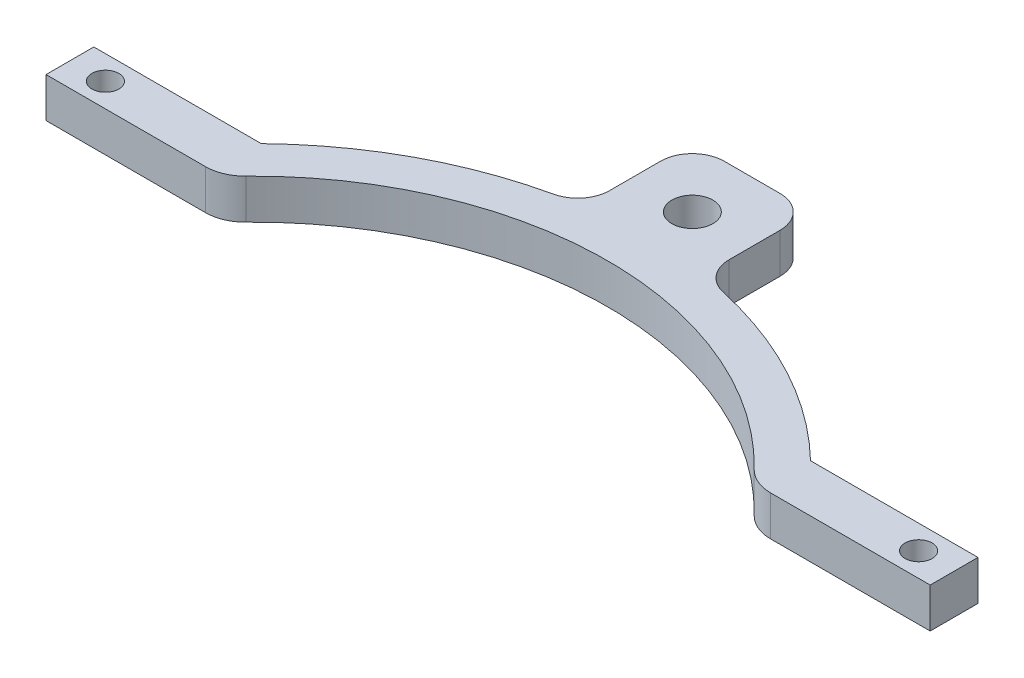
ISO-10303-21;
HEADER;
FILE_DESCRIPTION(('STEP AP214'),'2;1');
FILE_NAME('part.step','',(''),(''),'','','');
FILE_SCHEMA(('AUTOMOTIVE_DESIGN { 1 0 10303 214 1 1 1 1 }'));
ENDSEC;
DATA;
#1=APPLICATION_CONTEXT('core data for automotive mechanical design processes');
#2=APPLICATION_PROTOCOL_DEFINITION('international standard','automotive_design',2000,#1);
#3=PRODUCT_CONTEXT('',#1,'mechanical');
#4=PRODUCT('Part','Part','',(#3));
#5=PRODUCT_RELATED_PRODUCT_CATEGORY('part','',(#4));
#6=PRODUCT_DEFINITION_FORMATION('','',#4);
#7=PRODUCT_DEFINITION_CONTEXT('part definition',#1,'design');
#8=PRODUCT_DEFINITION('design','',#6,#7);
#9=PRODUCT_DEFINITION_SHAPE('','',#8);
#10=(LENGTH_UNIT() NAMED_UNIT(*) SI_UNIT(.MILLI.,.METRE.));
#11=(NAMED_UNIT(*) PLANE_ANGLE_UNIT() SI_UNIT($,.RADIAN.));
#12=(NAMED_UNIT(*) SI_UNIT($,.STERADIAN.) SOLID_ANGLE_UNIT());
#13=UNCERTAINTY_MEASURE_WITH_UNIT(LENGTH_MEASURE(1.E-05),#10,'distance_accuracy_value','');
#14=(GEOMETRIC_REPRESENTATION_CONTEXT(3) GLOBAL_UNCERTAINTY_ASSIGNED_CONTEXT((#13)) GLOBAL_UNIT_ASSIGNED_CONTEXT((#10,
#11,#12)) REPRESENTATION_CONTEXT('',''));
#15=CARTESIAN_POINT('',(0.,0.,0.));
#16=DIRECTION('',(0.,0.,1.));
#17=DIRECTION('',(1.,0.,0.));
#18=AXIS2_PLACEMENT_3D('',#15,#16,#17);
#19=CARTESIAN_POINT('',(0.,6.35,0.));
#20=DIRECTION('',(0.,-1.,0.));
#21=DIRECTION('',(0.,0.,-1.));
#22=AXIS2_PLACEMENT_3D('',#19,#20,#21);
#23=CYLINDRICAL_SURFACE('',#22,62.70625);
#24=CARTESIAN_POINT('',(0.,6.35,0.));
#25=DIRECTION('',(0.,1.,0.));
#26=DIRECTION('',(0.,0.,1.));
#27=AXIS2_PLACEMENT_3D('',#24,#25,#26);
#28=CIRCLE('',#27,62.70625);
#29=CARTESIAN_POINT('',(43.7394015311424,6.35,-44.9326));
#30=VERTEX_POINT('',#29);
#31=CARTESIAN_POINT('',(13.5104800936768,6.35,-61.2334934223164));
#32=VERTEX_POINT('',#31);
#33=EDGE_CURVE('E55',#30,#32,#28,.T.);
#34=ORIENTED_EDGE('',*,*,#33,.F.);
#35=DIRECTION('',(0.,1.,0.));
#36=VECTOR('',#35,1.);
#37=CARTESIAN_POINT('',(43.7394015311424,0.,-44.9326));
#38=LINE('',#37,#36);
#39=CARTESIAN_POINT('',(43.7394015311424,0.,-44.9326));
#40=VERTEX_POINT('',#39);
#41=EDGE_CURVE('E59',#40,#30,#38,.T.);
#42=ORIENTED_EDGE('',*,*,#41,.F.);
#43=CARTESIAN_POINT('',(0.,0.,0.));
#44=DIRECTION('',(0.,1.,0.));
#45=DIRECTION('',(0.,0.,1.));
#46=AXIS2_PLACEMENT_3D('',#43,#44,#45);
#47=CIRCLE('',#46,62.70625);
#48=CARTESIAN_POINT('',(13.5104800936768,0.,-61.2334934223164));
#49=VERTEX_POINT('',#48);
#50=EDGE_CURVE('E286',#40,#49,#47,.T.);
#51=ORIENTED_EDGE('',*,*,#50,.T.);
#52=DIRECTION('',(0.,-1.,0.));
#53=VECTOR('',#52,1.);
#54=CARTESIAN_POINT('',(13.5104800936768,6.35,-61.2334934223164));
#55=LINE('',#54,#53);
#56=EDGE_CURVE('E333',#49,#32,#55,.F.);
#57=ORIENTED_EDGE('',*,*,#56,.T.);
#58=EDGE_LOOP('',(#34,#42,#51,#57));
#59=FACE_BOUND('',#58,.T.);
#60=ADVANCED_FACE('F39',(#59),#23,.T.);
#61=CARTESIAN_POINT('',(0.,6.35,0.));
#62=DIRECTION('',(0.,1.,0.));
#63=DIRECTION('',(0.,0.,1.));
#64=AXIS2_PLACEMENT_3D('',#61,#62,#63);
#65=PLANE('',#64);
#66=DIRECTION('',(-1.,0.,0.));
#67=VECTOR('',#66,1.);
#68=CARTESIAN_POINT('',(-84.8924444444444,6.35,-37.3126));
#69=LINE('',#68,#67);
#70=CARTESIAN_POINT('',(70.4160811266374,6.35,-37.3126));
#71=VERTEX_POINT('',#70);
#72=CARTESIAN_POINT('',(45.0160811266374,6.35,-37.3126));
#73=VERTEX_POINT('',#72);
#74=EDGE_CURVE('E247',#71,#73,#69,.T.);
#75=ORIENTED_EDGE('',*,*,#74,.F.);
#76=DIRECTION('',(0.,0.,-1.));
#77=VECTOR('',#76,1.);
#78=CARTESIAN_POINT('',(70.4160811266374,6.35,-37.3126));
#79=LINE('',#78,#77);
#80=CARTESIAN_POINT('',(70.4160811266374,6.35,-44.9326));
#81=VERTEX_POINT('',#80);
#82=EDGE_CURVE('E183',#71,#81,#79,.T.);
#83=ORIENTED_EDGE('',*,*,#82,.T.);
#84=DIRECTION('',(-1.,0.,0.));
#85=VECTOR('',#84,1.);
#86=CARTESIAN_POINT('',(70.4160811266374,6.35,-44.9326));
#87=LINE('',#86,#85);
#88=EDGE_CURVE('E193',#81,#30,#87,.T.);
#89=ORIENTED_EDGE('',*,*,#88,.T.);
#90=ORIENTED_EDGE('',*,*,#33,.T.);
#91=CARTESIAN_POINT('',(14.605,6.35,-66.1941814970357));
#92=DIRECTION('',(0.,1.,0.));
#93=DIRECTION('',(0.,0.,1.));
#94=AXIS2_PLACEMENT_3D('',#91,#92,#93);
#95=CIRCLE('',#94,5.08);
#96=CARTESIAN_POINT('',(9.525,6.35,-66.1941814970357));
#97=VERTEX_POINT('',#96);
#98=EDGE_CURVE('E336',#32,#97,#95,.F.);
#99=ORIENTED_EDGE('',*,*,#98,.T.);
#100=DIRECTION('',(0.,0.,-1.));
#101=VECTOR('',#100,1.);
#102=CARTESIAN_POINT('',(9.525,6.35,-79.375));
#103=LINE('',#102,#101);
#104=CARTESIAN_POINT('',(9.525,6.35,-74.295));
#105=VERTEX_POINT('',#104);
#106=EDGE_CURVE('E275',#97,#105,#103,.T.);
#107=ORIENTED_EDGE('',*,*,#106,.T.);
#108=CARTESIAN_POINT('',(4.445,6.35,-74.295));
#109=DIRECTION('',(0.,1.,0.));
#110=DIRECTION('',(0.,0.,1.));
#111=AXIS2_PLACEMENT_3D('',#108,#109,#110);
#112=CIRCLE('',#111,5.08);
#113=CARTESIAN_POINT('',(4.445,6.35,-79.375));
#114=VERTEX_POINT('',#113);
#115=EDGE_CURVE('E304',#105,#114,#112,.T.);
#116=ORIENTED_EDGE('',*,*,#115,.T.);
#117=DIRECTION('',(-1.,0.,0.));
#118=VECTOR('',#117,1.);
#119=CARTESIAN_POINT('',(-9.525,6.35,-79.375));
#120=LINE('',#119,#118);
#121=CARTESIAN_POINT('',(-4.445,6.35,-79.375));
#122=VERTEX_POINT('',#121);
#123=EDGE_CURVE('E263',#114,#122,#120,.T.);
#124=ORIENTED_EDGE('',*,*,#123,.T.);
#125=CARTESIAN_POINT('',(-4.445,6.35,-74.295));
#126=DIRECTION('',(0.,1.,0.));
#127=DIRECTION('',(0.,0.,1.));
#128=AXIS2_PLACEMENT_3D('',#125,#126,#127);
#129=CIRCLE('',#128,5.08);
#130=CARTESIAN_POINT('',(-9.525,6.35,-74.295));
#131=VERTEX_POINT('',#130);
#132=EDGE_CURVE('E307',#122,#131,#129,.T.);
#133=ORIENTED_EDGE('',*,*,#132,.T.);
#134=DIRECTION('',(0.,0.,1.));
#135=VECTOR('',#134,1.);
#136=CARTESIAN_POINT('',(-9.525,6.35,-60.5427289688879));
#137=LINE('',#136,#135);
#138=CARTESIAN_POINT('',(-9.525,6.35,-66.1941814970357));
#139=VERTEX_POINT('',#138);
#140=EDGE_CURVE('E254',#131,#139,#137,.T.);
#141=ORIENTED_EDGE('',*,*,#140,.T.);
#142=CARTESIAN_POINT('',(-14.605,6.35,-66.1941814970357));
#143=DIRECTION('',(0.,1.,0.));
#144=DIRECTION('',(0.,0.,1.));
#145=AXIS2_PLACEMENT_3D('',#142,#143,#144);
#146=CIRCLE('',#145,5.08);
#147=CARTESIAN_POINT('',(-13.5104800936768,6.35,-61.2334934223164));
#148=VERTEX_POINT('',#147);
#149=EDGE_CURVE('E346',#139,#148,#146,.F.);
#150=ORIENTED_EDGE('',*,*,#149,.T.);
#151=CARTESIAN_POINT('',(-43.7394015311424,6.35,-44.9326));
#152=VERTEX_POINT('',#151);
#153=EDGE_CURVE('E290',#148,#152,#28,.T.);
#154=ORIENTED_EDGE('',*,*,#153,.T.);
#155=DIRECTION('',(-1.,0.,0.));
#156=VECTOR('',#155,1.);
#157=CARTESIAN_POINT('',(-70.4160811266374,6.35,-44.9326));
#158=LINE('',#157,#156);
#159=CARTESIAN_POINT('',(-70.4160811266374,6.35,-44.9326));
#160=VERTEX_POINT('',#159);
#161=EDGE_CURVE('E216',#152,#160,#158,.T.);
#162=ORIENTED_EDGE('',*,*,#161,.T.);
#163=DIRECTION('',(0.,0.,1.));
#164=VECTOR('',#163,1.);
#165=CARTESIAN_POINT('',(-70.4160811266374,6.35,-37.3126));
#166=LINE('',#165,#164);
#167=CARTESIAN_POINT('',(-70.4160811266374,6.35,-37.3126));
#168=VERTEX_POINT('',#167);
#169=EDGE_CURVE('E225',#160,#168,#166,.T.);
#170=ORIENTED_EDGE('',*,*,#169,.T.);
#171=CARTESIAN_POINT('',(-45.0160811266374,6.35,-37.3126));
#172=VERTEX_POINT('',#171);
#173=EDGE_CURVE('E240',#172,#168,#69,.T.);
#174=ORIENTED_EDGE('',*,*,#173,.F.);
#175=CARTESIAN_POINT('',(-45.0160811266374,6.35,-43.6626));
#176=DIRECTION('',(0.,1.,0.));
#177=DIRECTION('',(0.,0.,1.));
#178=AXIS2_PLACEMENT_3D('',#175,#176,#177);
#179=CIRCLE('',#178,6.35);
#180=CARTESIAN_POINT('',(-40.4579522154753,6.35,-39.2415185905224));
#181=VERTEX_POINT('',#180);
#182=EDGE_CURVE('E363',#172,#181,#179,.T.);
#183=ORIENTED_EDGE('',*,*,#182,.T.);
#184=CARTESIAN_POINT('',(0.,6.35,0.));
#185=DIRECTION('',(0.,1.,0.));
#186=DIRECTION('',(0.,0.,1.));
#187=AXIS2_PLACEMENT_3D('',#184,#185,#186);
#188=CIRCLE('',#187,56.3626);
#189=CARTESIAN_POINT('',(40.4579522154752,6.35,-39.2415185905225));
#190=VERTEX_POINT('',#189);
#191=EDGE_CURVE('E282',#190,#181,#188,.T.);
#192=ORIENTED_EDGE('',*,*,#191,.F.);
#193=CARTESIAN_POINT('',(45.0160811266374,6.35,-43.6626));
#194=DIRECTION('',(0.,1.,0.));
#195=DIRECTION('',(0.,0.,1.));
#196=AXIS2_PLACEMENT_3D('',#193,#194,#195);
#197=CIRCLE('',#196,6.35);
#198=EDGE_CURVE('E48',#190,#73,#197,.T.);
#199=ORIENTED_EDGE('',*,*,#198,.T.);
#200=EDGE_LOOP('',(#75,#83,#89,#90,#99,#107,#116,#124,#133,#141,#150,#154,#162,#170,#174,#183,
#192,#199));
#201=FACE_BOUND('',#200,.T.);
#202=CARTESIAN_POINT('',(0.,6.35,-69.85));
#203=DIRECTION('',(0.,-1.,0.));
#204=DIRECTION('',(0.,0.,-1.));
#205=AXIS2_PLACEMENT_3D('',#202,#203,#204);
#206=CIRCLE('',#205,3.2639);
#207=CARTESIAN_POINT('',(0.,6.35,-73.1139));
#208=VERTEX_POINT('',#207);
#209=EDGE_CURVE('E250',#208,#208,#206,.T.);
#210=ORIENTED_EDGE('',*,*,#209,.T.);
#211=EDGE_LOOP('',(#210));
#212=FACE_BOUND('',#211,.T.);
#213=CARTESIAN_POINT('',(-64.77,6.35,-41.1226));
#214=DIRECTION('',(0.,1.,0.));
#215=DIRECTION('',(0.,0.,1.));
#216=AXIS2_PLACEMENT_3D('',#213,#214,#215);
#217=CIRCLE('',#216,2.15265000000001);
#218=CARTESIAN_POINT('',(-64.77,6.35,-38.96995));
#219=VERTEX_POINT('',#218);
#220=EDGE_CURVE('E209',#219,#219,#217,.T.);
#221=ORIENTED_EDGE('',*,*,#220,.F.);
#222=EDGE_LOOP('',(#221));
#223=FACE_BOUND('',#222,.T.);
#224=CARTESIAN_POINT('',(64.77,6.35,-41.1226));
#225=DIRECTION('',(0.,1.,0.));
#226=DIRECTION('',(0.,0.,-1.));
#227=AXIS2_PLACEMENT_3D('',#224,#225,#226);
#228=CIRCLE('',#227,2.15265000000001);
#229=CARTESIAN_POINT('',(64.77,6.35,-43.27525));
#230=VERTEX_POINT('',#229);
#231=EDGE_CURVE('E201',#230,#230,#228,.T.);
#232=ORIENTED_EDGE('',*,*,#231,.F.);
#233=EDGE_LOOP('',(#232));
#234=FACE_BOUND('',#233,.T.);
#235=ADVANCED_FACE('F369',(#201,#212,#223,#234),#65,.T.);
#236=CARTESIAN_POINT('',(0.,0.,0.));
#237=DIRECTION('',(0.,1.,0.));
#238=DIRECTION('',(0.,0.,1.));
#239=AXIS2_PLACEMENT_3D('',#236,#237,#238);
#240=PLANE('',#239);
#241=CARTESIAN_POINT('',(0.,0.,-69.85));
#242=DIRECTION('',(0.,-1.,0.));
#243=DIRECTION('',(0.,0.,-1.));
#244=AXIS2_PLACEMENT_3D('',#241,#242,#243);
#245=CIRCLE('',#244,3.2639);
#246=CARTESIAN_POINT('',(0.,0.,-73.1139));
#247=VERTEX_POINT('',#246);
#248=EDGE_CURVE('E175',#247,#247,#245,.T.);
#249=ORIENTED_EDGE('',*,*,#248,.F.);
#250=EDGE_LOOP('',(#249));
#251=FACE_BOUND('',#250,.T.);
#252=ORIENTED_EDGE('',*,*,#50,.F.);
#253=DIRECTION('',(-1.,0.,0.));
#254=VECTOR('',#253,1.);
#255=CARTESIAN_POINT('',(70.4160811266374,0.,-44.9326));
#256=LINE('',#255,#254);
#257=CARTESIAN_POINT('',(70.4160811266374,0.,-44.9326));
#258=VERTEX_POINT('',#257);
#259=EDGE_CURVE('E186',#258,#40,#256,.T.);
#260=ORIENTED_EDGE('',*,*,#259,.F.);
#261=DIRECTION('',(0.,0.,-1.));
#262=VECTOR('',#261,1.);
#263=CARTESIAN_POINT('',(70.4160811266374,0.,-37.3126));
#264=LINE('',#263,#262);
#265=CARTESIAN_POINT('',(70.4160811266374,0.,-37.3126));
#266=VERTEX_POINT('',#265);
#267=EDGE_CURVE('E181',#266,#258,#264,.T.);
#268=ORIENTED_EDGE('',*,*,#267,.F.);
#269=DIRECTION('',(-1.,0.,0.));
#270=VECTOR('',#269,1.);
#271=CARTESIAN_POINT('',(-84.8924444444444,0.,-37.3126));
#272=LINE('',#271,#270);
#273=CARTESIAN_POINT('',(45.0160811266374,0.,-37.3126));
#274=VERTEX_POINT('',#273);
#275=EDGE_CURVE('E164',#266,#274,#272,.T.);
#276=ORIENTED_EDGE('',*,*,#275,.T.);
#277=CARTESIAN_POINT('',(45.0160811266374,0.,-43.6626));
#278=DIRECTION('',(0.,1.,0.));
#279=DIRECTION('',(0.,0.,1.));
#280=AXIS2_PLACEMENT_3D('',#277,#278,#279);
#281=CIRCLE('',#280,6.35);
#282=CARTESIAN_POINT('',(40.4579522154752,0.,-39.2415185905225));
#283=VERTEX_POINT('',#282);
#284=EDGE_CURVE('E354',#274,#283,#281,.F.);
#285=ORIENTED_EDGE('',*,*,#284,.T.);
#286=CARTESIAN_POINT('',(0.,0.,0.));
#287=DIRECTION('',(0.,1.,0.));
#288=DIRECTION('',(0.,0.,1.));
#289=AXIS2_PLACEMENT_3D('',#286,#287,#288);
#290=CIRCLE('',#289,56.3626);
#291=CARTESIAN_POINT('',(-40.4579522154753,0.,-39.2415185905224));
#292=VERTEX_POINT('',#291);
#293=EDGE_CURVE('E271',#283,#292,#290,.T.);
#294=ORIENTED_EDGE('',*,*,#293,.T.);
#295=CARTESIAN_POINT('',(-45.0160811266374,0.,-43.6626));
#296=DIRECTION('',(0.,1.,0.));
#297=DIRECTION('',(0.,0.,1.));
#298=AXIS2_PLACEMENT_3D('',#295,#296,#297);
#299=CIRCLE('',#298,6.35);
#300=CARTESIAN_POINT('',(-45.0160811266374,0.,-37.3126));
#301=VERTEX_POINT('',#300);
#302=EDGE_CURVE('E351',#292,#301,#299,.F.);
#303=ORIENTED_EDGE('',*,*,#302,.T.);
#304=CARTESIAN_POINT('',(-70.4160811266374,0.,-37.3126));
#305=VERTEX_POINT('',#304);
#306=EDGE_CURVE('E176',#301,#305,#272,.T.);
#307=ORIENTED_EDGE('',*,*,#306,.T.);
#308=DIRECTION('',(0.,0.,1.));
#309=VECTOR('',#308,1.);
#310=CARTESIAN_POINT('',(-70.4160811266374,0.,-37.3126));
#311=LINE('',#310,#309);
#312=CARTESIAN_POINT('',(-70.4160811266374,0.,-44.9326));
#313=VERTEX_POINT('',#312);
#314=EDGE_CURVE('E224',#313,#305,#311,.T.);
#315=ORIENTED_EDGE('',*,*,#314,.F.);
#316=DIRECTION('',(-1.,0.,0.));
#317=VECTOR('',#316,1.);
#318=CARTESIAN_POINT('',(-70.4160811266374,0.,-44.9326));
#319=LINE('',#318,#317);
#320=CARTESIAN_POINT('',(-43.7394015311424,0.,-44.9326));
#321=VERTEX_POINT('',#320);
#322=EDGE_CURVE('E220',#321,#313,#319,.T.);
#323=ORIENTED_EDGE('',*,*,#322,.F.);
#324=CARTESIAN_POINT('',(-13.5104800936768,0.,-61.2334934223164));
#325=VERTEX_POINT('',#324);
#326=EDGE_CURVE('E295',#325,#321,#47,.T.);
#327=ORIENTED_EDGE('',*,*,#326,.F.);
#328=CARTESIAN_POINT('',(-14.605,0.,-66.1941814970357));
#329=DIRECTION('',(0.,1.,0.));
#330=DIRECTION('',(0.,0.,1.));
#331=AXIS2_PLACEMENT_3D('',#328,#329,#330);
#332=CIRCLE('',#331,5.08);
#333=CARTESIAN_POINT('',(-9.525,0.,-66.1941814970357));
#334=VERTEX_POINT('',#333);
#335=EDGE_CURVE('E343',#325,#334,#332,.T.);
#336=ORIENTED_EDGE('',*,*,#335,.T.);
#337=DIRECTION('',(0.,0.,1.));
#338=VECTOR('',#337,1.);
#339=CARTESIAN_POINT('',(-9.525,0.,-60.5427289688879));
#340=LINE('',#339,#338);
#341=CARTESIAN_POINT('',(-9.525,0.,-74.295));
#342=VERTEX_POINT('',#341);
#343=EDGE_CURVE('E258',#342,#334,#340,.T.);
#344=ORIENTED_EDGE('',*,*,#343,.F.);
#345=CARTESIAN_POINT('',(-4.445,0.,-74.295));
#346=DIRECTION('',(0.,1.,0.));
#347=DIRECTION('',(0.,0.,1.));
#348=AXIS2_PLACEMENT_3D('',#345,#346,#347);
#349=CIRCLE('',#348,5.08);
#350=CARTESIAN_POINT('',(-4.445,0.,-79.375));
#351=VERTEX_POINT('',#350);
#352=EDGE_CURVE('E319',#342,#351,#349,.F.);
#353=ORIENTED_EDGE('',*,*,#352,.T.);
#354=DIRECTION('',(-1.,0.,0.));
#355=VECTOR('',#354,1.);
#356=CARTESIAN_POINT('',(-9.525,0.,-79.375));
#357=LINE('',#356,#355);
#358=CARTESIAN_POINT('',(4.445,0.,-79.375));
#359=VERTEX_POINT('',#358);
#360=EDGE_CURVE('E267',#359,#351,#357,.T.);
#361=ORIENTED_EDGE('',*,*,#360,.F.);
#362=CARTESIAN_POINT('',(4.445,0.,-74.295));
#363=DIRECTION('',(0.,1.,0.));
#364=DIRECTION('',(0.,0.,1.));
#365=AXIS2_PLACEMENT_3D('',#362,#363,#364);
#366=CIRCLE('',#365,5.08);
#367=CARTESIAN_POINT('',(9.525,0.,-74.295));
#368=VERTEX_POINT('',#367);
#369=EDGE_CURVE('E316',#359,#368,#366,.F.);
#370=ORIENTED_EDGE('',*,*,#369,.T.);
#371=DIRECTION('',(0.,0.,-1.));
#372=VECTOR('',#371,1.);
#373=CARTESIAN_POINT('',(9.525,0.,-79.375));
#374=LINE('',#373,#372);
#375=CARTESIAN_POINT('',(9.525,0.,-66.1941814970357));
#376=VERTEX_POINT('',#375);
#377=EDGE_CURVE('E262',#376,#368,#374,.T.);
#378=ORIENTED_EDGE('',*,*,#377,.F.);
#379=CARTESIAN_POINT('',(14.605,0.,-66.1941814970357));
#380=DIRECTION('',(0.,1.,0.));
#381=DIRECTION('',(0.,0.,1.));
#382=AXIS2_PLACEMENT_3D('',#379,#380,#381);
#383=CIRCLE('',#382,5.08);
#384=EDGE_CURVE('E339',#376,#49,#383,.T.);
#385=ORIENTED_EDGE('',*,*,#384,.T.);
#386=EDGE_LOOP('',(#252,#260,#268,#276,#285,#294,#303,#307,#315,#323,#327,#336,#344,#353,#361,
#370,#378,#385));
#387=FACE_BOUND('',#386,.T.);
#388=CARTESIAN_POINT('',(-64.77,0.,-41.1226));
#389=DIRECTION('',(0.,1.,0.));
#390=DIRECTION('',(0.,0.,1.));
#391=AXIS2_PLACEMENT_3D('',#388,#389,#390);
#392=CIRCLE('',#391,2.15265000000001);
#393=CARTESIAN_POINT('',(-64.77,0.,-38.96995));
#394=VERTEX_POINT('',#393);
#395=EDGE_CURVE('E212',#394,#394,#392,.T.);
#396=ORIENTED_EDGE('',*,*,#395,.T.);
#397=EDGE_LOOP('',(#396));
#398=FACE_BOUND('',#397,.T.);
#399=CARTESIAN_POINT('',(64.77,0.,-41.1226));
#400=DIRECTION('',(0.,1.,0.));
#401=DIRECTION('',(0.,0.,-1.));
#402=AXIS2_PLACEMENT_3D('',#399,#400,#401);
#403=CIRCLE('',#402,2.15265000000001);
#404=CARTESIAN_POINT('',(64.77,0.,-43.27525));
#405=VERTEX_POINT('',#404);
#406=EDGE_CURVE('E205',#405,#405,#403,.T.);
#407=ORIENTED_EDGE('',*,*,#406,.T.);
#408=EDGE_LOOP('',(#407));
#409=FACE_BOUND('',#408,.T.);
#410=ADVANCED_FACE('F189',(#251,#387,#398,#409),#240,.F.);
#411=ORIENTED_EDGE('',*,*,#326,.T.);
#412=DIRECTION('',(0.,1.,0.));
#413=VECTOR('',#412,1.);
#414=CARTESIAN_POINT('',(-43.7394015311424,0.,-44.9326));
#415=LINE('',#414,#413);
#416=EDGE_CURVE('E229',#321,#152,#415,.T.);
#417=ORIENTED_EDGE('',*,*,#416,.T.);
#418=ORIENTED_EDGE('',*,*,#153,.F.);
#419=DIRECTION('',(0.,-1.,0.));
#420=VECTOR('',#419,1.);
#421=CARTESIAN_POINT('',(-13.5104800936768,6.35,-61.2334934223164));
#422=LINE('',#421,#420);
#423=EDGE_CURVE('E329',#148,#325,#422,.T.);
#424=ORIENTED_EDGE('',*,*,#423,.T.);
#425=EDGE_LOOP('',(#411,#417,#418,#424));
#426=FACE_BOUND('',#425,.T.);
#427=ADVANCED_FACE('F399',(#426),#23,.T.);
#428=CARTESIAN_POINT('',(0.,6.35,0.));
#429=DIRECTION('',(0.,-1.,0.));
#430=DIRECTION('',(0.,0.,-1.));
#431=AXIS2_PLACEMENT_3D('',#428,#429,#430);
#432=CYLINDRICAL_SURFACE('',#431,56.3626);
#433=ORIENTED_EDGE('',*,*,#293,.F.);
#434=DIRECTION('',(0.,-1.,0.));
#435=VECTOR('',#434,1.);
#436=CARTESIAN_POINT('',(40.4579522154752,6.35,-39.2415185905225));
#437=LINE('',#436,#435);
#438=EDGE_CURVE('E360',#283,#190,#437,.F.);
#439=ORIENTED_EDGE('',*,*,#438,.T.);
#440=ORIENTED_EDGE('',*,*,#191,.T.);
#441=DIRECTION('',(0.,-1.,0.));
#442=VECTOR('',#441,1.);
#443=CARTESIAN_POINT('',(-40.4579522154753,6.35,-39.2415185905224));
#444=LINE('',#443,#442);
#445=EDGE_CURVE('E357',#181,#292,#444,.T.);
#446=ORIENTED_EDGE('',*,*,#445,.T.);
#447=EDGE_LOOP('',(#433,#439,#440,#446));
#448=FACE_BOUND('',#447,.T.);
#449=ADVANCED_FACE('F378',(#448),#432,.F.);
#450=CARTESIAN_POINT('',(-9.525,0.,-60.5427289688879));
#451=DIRECTION('',(-1.,0.,0.));
#452=DIRECTION('',(0.,0.,1.));
#453=AXIS2_PLACEMENT_3D('',#450,#451,#452);
#454=PLANE('',#453);
#455=ORIENTED_EDGE('',*,*,#140,.F.);
#456=DIRECTION('',(0.,1.,0.));
#457=VECTOR('',#456,1.);
#458=CARTESIAN_POINT('',(-9.525,0.,-74.295));
#459=LINE('',#458,#457);
#460=EDGE_CURVE('E313',#131,#342,#459,.F.);
#461=ORIENTED_EDGE('',*,*,#460,.T.);
#462=ORIENTED_EDGE('',*,*,#343,.T.);
#463=DIRECTION('',(0.,-1.,0.));
#464=VECTOR('',#463,1.);
#465=CARTESIAN_POINT('',(-9.525,0.,-66.1941814970357));
#466=LINE('',#465,#464);
#467=EDGE_CURVE('E310',#334,#139,#466,.F.);
#468=ORIENTED_EDGE('',*,*,#467,.T.);
#469=EDGE_LOOP('',(#455,#461,#462,#468));
#470=FACE_BOUND('',#469,.T.);
#471=ADVANCED_FACE('F409',(#470),#454,.T.);
#472=CARTESIAN_POINT('',(9.525,0.,-79.375));
#473=DIRECTION('',(1.,0.,0.));
#474=DIRECTION('',(0.,0.,-1.));
#475=AXIS2_PLACEMENT_3D('',#472,#473,#474);
#476=PLANE('',#475);
#477=ORIENTED_EDGE('',*,*,#377,.T.);
#478=DIRECTION('',(0.,1.,0.));
#479=VECTOR('',#478,1.);
#480=CARTESIAN_POINT('',(9.525,0.,-74.295));
#481=LINE('',#480,#479);
#482=EDGE_CURVE('E325',#368,#105,#481,.T.);
#483=ORIENTED_EDGE('',*,*,#482,.T.);
#484=ORIENTED_EDGE('',*,*,#106,.F.);
#485=DIRECTION('',(0.,-1.,0.));
#486=VECTOR('',#485,1.);
#487=CARTESIAN_POINT('',(9.525,0.,-66.1941814970357));
#488=LINE('',#487,#486);
#489=EDGE_CURVE('E322',#97,#376,#488,.T.);
#490=ORIENTED_EDGE('',*,*,#489,.T.);
#491=EDGE_LOOP('',(#477,#483,#484,#490));
#492=FACE_BOUND('',#491,.T.);
#493=ADVANCED_FACE('F426',(#492),#476,.T.);
#494=CARTESIAN_POINT('',(-9.525,0.,-79.375));
#495=DIRECTION('',(0.,0.,-1.));
#496=DIRECTION('',(-1.,0.,0.));
#497=AXIS2_PLACEMENT_3D('',#494,#495,#496);
#498=PLANE('',#497);
#499=ORIENTED_EDGE('',*,*,#360,.T.);
#500=DIRECTION('',(0.,1.,0.));
#501=VECTOR('',#500,1.);
#502=CARTESIAN_POINT('',(-4.445,0.,-79.375));
#503=LINE('',#502,#501);
#504=EDGE_CURVE('E300',#351,#122,#503,.T.);
#505=ORIENTED_EDGE('',*,*,#504,.T.);
#506=ORIENTED_EDGE('',*,*,#123,.F.);
#507=DIRECTION('',(0.,1.,0.));
#508=VECTOR('',#507,1.);
#509=CARTESIAN_POINT('',(4.445,0.,-79.375));
#510=LINE('',#509,#508);
#511=EDGE_CURVE('E294',#114,#359,#510,.F.);
#512=ORIENTED_EDGE('',*,*,#511,.T.);
#513=EDGE_LOOP('',(#499,#505,#506,#512));
#514=FACE_BOUND('',#513,.T.);
#515=ADVANCED_FACE('F417',(#514),#498,.T.);
#516=CARTESIAN_POINT('',(-4.445,0.,-74.295));
#517=DIRECTION('',(0.,1.,0.));
#518=DIRECTION('',(0.,0.,1.));
#519=AXIS2_PLACEMENT_3D('',#516,#517,#518);
#520=CYLINDRICAL_SURFACE('',#519,5.08);
#521=ORIENTED_EDGE('',*,*,#352,.F.);
#522=ORIENTED_EDGE('',*,*,#460,.F.);
#523=ORIENTED_EDGE('',*,*,#132,.F.);
#524=ORIENTED_EDGE('',*,*,#504,.F.);
#525=EDGE_LOOP('',(#521,#522,#523,#524));
#526=FACE_BOUND('',#525,.T.);
#527=ADVANCED_FACE('F412',(#526),#520,.T.);
#528=CARTESIAN_POINT('',(4.445,0.,-74.295));
#529=DIRECTION('',(0.,1.,0.));
#530=DIRECTION('',(0.,0.,1.));
#531=AXIS2_PLACEMENT_3D('',#528,#529,#530);
#532=CYLINDRICAL_SURFACE('',#531,5.08);
#533=ORIENTED_EDGE('',*,*,#369,.F.);
#534=ORIENTED_EDGE('',*,*,#511,.F.);
#535=ORIENTED_EDGE('',*,*,#115,.F.);
#536=ORIENTED_EDGE('',*,*,#482,.F.);
#537=EDGE_LOOP('',(#533,#534,#535,#536));
#538=FACE_BOUND('',#537,.T.);
#539=ADVANCED_FACE('F421',(#538),#532,.T.);
#540=CARTESIAN_POINT('',(14.605,6.35,-66.1941814970357));
#541=DIRECTION('',(0.,-1.,0.));
#542=DIRECTION('',(0.,0.,-1.));
#543=AXIS2_PLACEMENT_3D('',#540,#541,#542);
#544=CYLINDRICAL_SURFACE('',#543,5.08);
#545=ORIENTED_EDGE('',*,*,#384,.F.);
#546=ORIENTED_EDGE('',*,*,#489,.F.);
#547=ORIENTED_EDGE('',*,*,#98,.F.);
#548=ORIENTED_EDGE('',*,*,#56,.F.);
#549=EDGE_LOOP('',(#545,#546,#547,#548));
#550=FACE_BOUND('',#549,.T.);
#551=ADVANCED_FACE('F431',(#550),#544,.F.);
#552=CARTESIAN_POINT('',(-14.605,6.35,-66.1941814970357));
#553=DIRECTION('',(0.,-1.,0.));
#554=DIRECTION('',(0.,0.,-1.));
#555=AXIS2_PLACEMENT_3D('',#552,#553,#554);
#556=CYLINDRICAL_SURFACE('',#555,5.08);
#557=ORIENTED_EDGE('',*,*,#149,.F.);
#558=ORIENTED_EDGE('',*,*,#467,.F.);
#559=ORIENTED_EDGE('',*,*,#335,.F.);
#560=ORIENTED_EDGE('',*,*,#423,.F.);
#561=EDGE_LOOP('',(#557,#558,#559,#560));
#562=FACE_BOUND('',#561,.T.);
#563=ADVANCED_FACE('F405',(#562),#556,.F.);
#564=CARTESIAN_POINT('',(0.,6.35,-69.85));
#565=DIRECTION('',(0.,-1.,0.));
#566=DIRECTION('',(0.,0.,-1.));
#567=AXIS2_PLACEMENT_3D('',#564,#565,#566);
#568=CYLINDRICAL_SURFACE('',#567,3.2639);
#569=ORIENTED_EDGE('',*,*,#209,.F.);
#570=EDGE_LOOP('',(#569));
#571=FACE_BOUND('',#570,.T.);
#572=ORIENTED_EDGE('',*,*,#248,.T.);
#573=EDGE_LOOP('',(#572));
#574=FACE_BOUND('',#573,.T.);
#575=ADVANCED_FACE('F475',(#571,#574),#568,.F.);
#576=CARTESIAN_POINT('',(-84.8924444444444,0.,-37.3126));
#577=DIRECTION('',(0.,0.,-1.));
#578=DIRECTION('',(-1.,0.,0.));
#579=AXIS2_PLACEMENT_3D('',#576,#577,#578);
#580=PLANE('',#579);
#581=ORIENTED_EDGE('',*,*,#306,.F.);
#582=DIRECTION('',(0.,1.,0.));
#583=VECTOR('',#582,1.);
#584=CARTESIAN_POINT('',(-45.0160811266374,6.35,-37.3126));
#585=LINE('',#584,#583);
#586=EDGE_CURVE('E11',#301,#172,#585,.T.);
#587=ORIENTED_EDGE('',*,*,#586,.T.);
#588=ORIENTED_EDGE('',*,*,#173,.T.);
#589=DIRECTION('',(0.,1.,0.));
#590=VECTOR('',#589,1.);
#591=CARTESIAN_POINT('',(-70.4160811266374,0.,-37.3126));
#592=LINE('',#591,#590);
#593=EDGE_CURVE('E236',#305,#168,#592,.T.);
#594=ORIENTED_EDGE('',*,*,#593,.F.);
#595=EDGE_LOOP('',(#581,#587,#588,#594));
#596=FACE_BOUND('',#595,.T.);
#597=ADVANCED_FACE('F386',(#596),#580,.F.);
#598=ORIENTED_EDGE('',*,*,#74,.T.);
#599=DIRECTION('',(0.,1.,0.));
#600=VECTOR('',#599,1.);
#601=CARTESIAN_POINT('',(45.0160811266374,0.,-37.3126));
#602=LINE('',#601,#600);
#603=EDGE_CURVE('E171',#73,#274,#602,.F.);
#604=ORIENTED_EDGE('',*,*,#603,.T.);
#605=ORIENTED_EDGE('',*,*,#275,.F.);
#606=DIRECTION('',(0.,1.,0.));
#607=VECTOR('',#606,1.);
#608=CARTESIAN_POINT('',(70.4160811266374,0.,-37.3126));
#609=LINE('',#608,#607);
#610=EDGE_CURVE('E168',#266,#71,#609,.T.);
#611=ORIENTED_EDGE('',*,*,#610,.T.);
#612=EDGE_LOOP('',(#598,#604,#605,#611));
#613=FACE_BOUND('',#612,.T.);
#614=ADVANCED_FACE('F167',(#613),#580,.F.);
#615=CARTESIAN_POINT('',(45.0160811266374,6.35,-43.6626));
#616=DIRECTION('',(0.,-1.,0.));
#617=DIRECTION('',(0.,0.,-1.));
#618=AXIS2_PLACEMENT_3D('',#615,#616,#617);
#619=CYLINDRICAL_SURFACE('',#618,6.35);
#620=ORIENTED_EDGE('',*,*,#198,.F.);
#621=ORIENTED_EDGE('',*,*,#438,.F.);
#622=ORIENTED_EDGE('',*,*,#284,.F.);
#623=ORIENTED_EDGE('',*,*,#603,.F.);
#624=EDGE_LOOP('',(#620,#621,#622,#623));
#625=FACE_BOUND('',#624,.T.);
#626=ADVANCED_FACE('F374',(#625),#619,.T.);
#627=CARTESIAN_POINT('',(-45.0160811266374,6.35,-43.6626));
#628=DIRECTION('',(0.,-1.,0.));
#629=DIRECTION('',(0.,0.,-1.));
#630=AXIS2_PLACEMENT_3D('',#627,#628,#629);
#631=CYLINDRICAL_SURFACE('',#630,6.35);
#632=ORIENTED_EDGE('',*,*,#302,.F.);
#633=ORIENTED_EDGE('',*,*,#445,.F.);
#634=ORIENTED_EDGE('',*,*,#182,.F.);
#635=ORIENTED_EDGE('',*,*,#586,.F.);
#636=EDGE_LOOP('',(#632,#633,#634,#635));
#637=FACE_BOUND('',#636,.T.);
#638=ADVANCED_FACE('F41',(#637),#631,.T.);
#639=CARTESIAN_POINT('',(-70.4160811266374,0.,-37.3126));
#640=DIRECTION('',(-1.,0.,0.));
#641=DIRECTION('',(0.,0.,1.));
#642=AXIS2_PLACEMENT_3D('',#639,#640,#641);
#643=PLANE('',#642);
#644=ORIENTED_EDGE('',*,*,#169,.F.);
#645=DIRECTION('',(0.,1.,0.));
#646=VECTOR('',#645,1.);
#647=CARTESIAN_POINT('',(-70.4160811266374,0.,-44.9326));
#648=LINE('',#647,#646);
#649=EDGE_CURVE('E241',#313,#160,#648,.T.);
#650=ORIENTED_EDGE('',*,*,#649,.F.);
#651=ORIENTED_EDGE('',*,*,#314,.T.);
#652=ORIENTED_EDGE('',*,*,#593,.T.);
#653=EDGE_LOOP('',(#644,#650,#651,#652));
#654=FACE_BOUND('',#653,.T.);
#655=ADVANCED_FACE('F390',(#654),#643,.T.);
#656=CARTESIAN_POINT('',(-70.4160811266374,0.,-44.9326));
#657=DIRECTION('',(0.,0.,-1.));
#658=DIRECTION('',(-1.,0.,0.));
#659=AXIS2_PLACEMENT_3D('',#656,#657,#658);
#660=PLANE('',#659);
#661=ORIENTED_EDGE('',*,*,#161,.F.);
#662=ORIENTED_EDGE('',*,*,#416,.F.);
#663=ORIENTED_EDGE('',*,*,#322,.T.);
#664=ORIENTED_EDGE('',*,*,#649,.T.);
#665=EDGE_LOOP('',(#661,#662,#663,#664));
#666=FACE_BOUND('',#665,.T.);
#667=ADVANCED_FACE('F396',(#666),#660,.T.);
#668=CARTESIAN_POINT('',(-64.77,0.,-41.1226));
#669=DIRECTION('',(0.,1.,0.));
#670=DIRECTION('',(0.,0.,1.));
#671=AXIS2_PLACEMENT_3D('',#668,#669,#670);
#672=CYLINDRICAL_SURFACE('',#671,2.15265000000001);
#673=ORIENTED_EDGE('',*,*,#395,.F.);
#674=EDGE_LOOP('',(#673));
#675=FACE_BOUND('',#674,.T.);
#676=ORIENTED_EDGE('',*,*,#220,.T.);
#677=EDGE_LOOP('',(#676));
#678=FACE_BOUND('',#677,.T.);
#679=ADVANCED_FACE('F439',(#675,#678),#672,.F.);
#680=CARTESIAN_POINT('',(70.4160811266374,0.,-44.9326));
#681=DIRECTION('',(0.,0.,-1.));
#682=DIRECTION('',(-1.,0.,0.));
#683=AXIS2_PLACEMENT_3D('',#680,#681,#682);
#684=PLANE('',#683);
#685=ORIENTED_EDGE('',*,*,#88,.F.);
#686=DIRECTION('',(0.,1.,0.));
#687=VECTOR('',#686,1.);
#688=CARTESIAN_POINT('',(70.4160811266374,0.,-44.9326));
#689=LINE('',#688,#687);
#690=EDGE_CURVE('E185',#258,#81,#689,.T.);
#691=ORIENTED_EDGE('',*,*,#690,.F.);
#692=ORIENTED_EDGE('',*,*,#259,.T.);
#693=ORIENTED_EDGE('',*,*,#41,.T.);
#694=EDGE_LOOP('',(#685,#691,#692,#693));
#695=FACE_BOUND('',#694,.T.);
#696=ADVANCED_FACE('F436',(#695),#684,.T.);
#697=CARTESIAN_POINT('',(70.4160811266374,0.,-37.3126));
#698=DIRECTION('',(1.,0.,0.));
#699=DIRECTION('',(0.,0.,-1.));
#700=AXIS2_PLACEMENT_3D('',#697,#698,#699);
#701=PLANE('',#700);
#702=ORIENTED_EDGE('',*,*,#82,.F.);
#703=ORIENTED_EDGE('',*,*,#610,.F.);
#704=ORIENTED_EDGE('',*,*,#267,.T.);
#705=ORIENTED_EDGE('',*,*,#690,.T.);
#706=EDGE_LOOP('',(#702,#703,#704,#705));
#707=FACE_BOUND('',#706,.T.);
#708=ADVANCED_FACE('F180',(#707),#701,.T.);
#709=CARTESIAN_POINT('',(64.77,0.,-41.1226));
#710=DIRECTION('',(0.,1.,0.));
#711=DIRECTION('',(0.,0.,1.));
#712=AXIS2_PLACEMENT_3D('',#709,#710,#711);
#713=CYLINDRICAL_SURFACE('',#712,2.15265000000001);
#714=ORIENTED_EDGE('',*,*,#406,.F.);
#715=EDGE_LOOP('',(#714));
#716=FACE_BOUND('',#715,.T.);
#717=ORIENTED_EDGE('',*,*,#231,.T.);
#718=EDGE_LOOP('',(#717));
#719=FACE_BOUND('',#718,.T.);
#720=ADVANCED_FACE('F445',(#716,#719),#713,.F.);
#721=CLOSED_SHELL('',(#60,#235,#410,#427,#449,#471,#493,#515,#527,#539,#551,#563,#575,#597,#614,
#626,#638,#655,#667,#679,#696,#708,#720));
#722=MANIFOLD_SOLID_BREP('B2',#721);
#723=ADVANCED_BREP_SHAPE_REPRESENTATION('',(#18,#722),#14);
#724=SHAPE_DEFINITION_REPRESENTATION(#9,#723);
ENDSEC;
END-ISO-10303-21;
